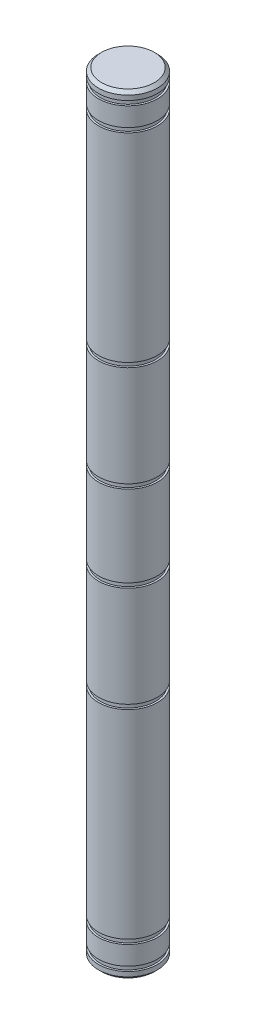
ISO-10303-21;
HEADER;
FILE_DESCRIPTION(('STEP AP214'),'2;1');
FILE_NAME('part.step','',(''),(''),'','','');
FILE_SCHEMA(('AUTOMOTIVE_DESIGN { 1 0 10303 214 1 1 1 1 }'));
ENDSEC;
DATA;
#1=APPLICATION_CONTEXT('core data for automotive mechanical design processes');
#2=APPLICATION_PROTOCOL_DEFINITION('international standard','automotive_design',2000,#1);
#3=PRODUCT_CONTEXT('',#1,'mechanical');
#4=PRODUCT('Part','Part','',(#3));
#5=PRODUCT_RELATED_PRODUCT_CATEGORY('part','',(#4));
#6=PRODUCT_DEFINITION_FORMATION('','',#4);
#7=PRODUCT_DEFINITION_CONTEXT('part definition',#1,'design');
#8=PRODUCT_DEFINITION('design','',#6,#7);
#9=PRODUCT_DEFINITION_SHAPE('','',#8);
#10=(LENGTH_UNIT() NAMED_UNIT(*) SI_UNIT(.MILLI.,.METRE.));
#11=(NAMED_UNIT(*) PLANE_ANGLE_UNIT() SI_UNIT($,.RADIAN.));
#12=(NAMED_UNIT(*) SI_UNIT($,.STERADIAN.) SOLID_ANGLE_UNIT());
#13=UNCERTAINTY_MEASURE_WITH_UNIT(LENGTH_MEASURE(1.E-05),#10,'distance_accuracy_value','');
#14=(GEOMETRIC_REPRESENTATION_CONTEXT(3) GLOBAL_UNCERTAINTY_ASSIGNED_CONTEXT((#13)) GLOBAL_UNIT_ASSIGNED_CONTEXT((#10,
#11,#12)) REPRESENTATION_CONTEXT('',''));
#15=CARTESIAN_POINT('',(0.,0.,0.));
#16=DIRECTION('',(0.,0.,1.));
#17=DIRECTION('',(1.,0.,0.));
#18=AXIS2_PLACEMENT_3D('',#15,#16,#17);
#19=CARTESIAN_POINT('',(0.,-62.23,0.));
#20=DIRECTION('',(0.,-1.,0.));
#21=DIRECTION('',(1.,0.,0.));
#22=AXIS2_PLACEMENT_3D('',#19,#20,#21);
#23=PLANE('',#22);
#24=CARTESIAN_POINT('',(0.,-62.23,0.));
#25=DIRECTION('',(0.,-1.,0.));
#26=DIRECTION('',(1.,0.,0.));
#27=AXIS2_PLACEMENT_3D('',#24,#25,#26);
#28=CIRCLE('',#27,4.25449999999998);
#29=CARTESIAN_POINT('',(4.25449999999998,-62.23,0.));
#30=VERTEX_POINT('',#29);
#31=EDGE_CURVE('E56',#30,#30,#28,.T.);
#32=ORIENTED_EDGE('',*,*,#31,.T.);
#33=EDGE_LOOP('',(#32));
#34=FACE_BOUND('',#33,.T.);
#35=ADVANCED_FACE('F45',(#34),#23,.T.);
#36=CARTESIAN_POINT('',(0.,62.23,0.));
#37=DIRECTION('',(0.,1.,0.));
#38=DIRECTION('',(-1.,0.,0.));
#39=AXIS2_PLACEMENT_3D('',#36,#37,#38);
#40=CYLINDRICAL_SURFACE('',#39,4.76249999999998);
#41=CARTESIAN_POINT('',(0.,-61.722,0.));
#42=DIRECTION('',(0.,-1.,0.));
#43=DIRECTION('',(1.,0.,0.));
#44=AXIS2_PLACEMENT_3D('',#41,#42,#43);
#45=CIRCLE('',#44,4.76249999999998);
#46=CARTESIAN_POINT('',(4.76249999999998,-61.722,0.));
#47=VERTEX_POINT('',#46);
#48=EDGE_CURVE('E60',#47,#47,#45,.F.);
#49=ORIENTED_EDGE('',*,*,#48,.T.);
#50=EDGE_LOOP('',(#49));
#51=FACE_BOUND('',#50,.T.);
#52=CARTESIAN_POINT('',(0.,-60.96,0.));
#53=DIRECTION('',(0.,1.,0.));
#54=DIRECTION('',(-1.,0.,0.));
#55=AXIS2_PLACEMENT_3D('',#52,#53,#54);
#56=CIRCLE('',#55,4.76249999999998);
#57=CARTESIAN_POINT('',(-4.76249999999998,-60.96,0.));
#58=VERTEX_POINT('',#57);
#59=EDGE_CURVE('E65',#58,#58,#56,.T.);
#60=ORIENTED_EDGE('',*,*,#59,.F.);
#61=EDGE_LOOP('',(#60));
#62=FACE_BOUND('',#61,.T.);
#63=ADVANCED_FACE('F179',(#51,#62),#40,.T.);
#64=CARTESIAN_POINT('',(-4.76249999999998,-60.96,0.));
#65=DIRECTION('',(0.,1.,0.));
#66=DIRECTION('',(-1.,0.,0.));
#67=AXIS2_PLACEMENT_3D('',#64,#65,#66);
#68=PLANE('',#67);
#69=ORIENTED_EDGE('',*,*,#59,.T.);
#70=EDGE_LOOP('',(#69));
#71=FACE_BOUND('',#70,.T.);
#72=CARTESIAN_POINT('',(0.,-60.96,0.));
#73=DIRECTION('',(0.,1.,0.));
#74=DIRECTION('',(-1.,0.,0.));
#75=AXIS2_PLACEMENT_3D('',#72,#73,#74);
#76=CIRCLE('',#75,4.45769999999998);
#77=CARTESIAN_POINT('',(-4.45769999999998,-60.96,0.));
#78=VERTEX_POINT('',#77);
#79=EDGE_CURVE('E68',#78,#78,#76,.T.);
#80=ORIENTED_EDGE('',*,*,#79,.F.);
#81=EDGE_LOOP('',(#80));
#82=FACE_BOUND('',#81,.T.);
#83=ADVANCED_FACE('F185',(#71,#82),#68,.T.);
#84=CARTESIAN_POINT('',(0.,62.23,0.));
#85=DIRECTION('',(0.,1.,0.));
#86=DIRECTION('',(-1.,0.,0.));
#87=AXIS2_PLACEMENT_3D('',#84,#85,#86);
#88=CYLINDRICAL_SURFACE('',#87,4.45769999999998);
#89=ORIENTED_EDGE('',*,*,#79,.T.);
#90=EDGE_LOOP('',(#89));
#91=FACE_BOUND('',#90,.T.);
#92=CARTESIAN_POINT('',(0.,-60.2234,0.));
#93=DIRECTION('',(0.,1.,0.));
#94=DIRECTION('',(-1.,0.,0.));
#95=AXIS2_PLACEMENT_3D('',#92,#93,#94);
#96=CIRCLE('',#95,4.45769999999998);
#97=CARTESIAN_POINT('',(-4.45769999999998,-60.2234,0.));
#98=VERTEX_POINT('',#97);
#99=EDGE_CURVE('E71',#98,#98,#96,.T.);
#100=ORIENTED_EDGE('',*,*,#99,.F.);
#101=EDGE_LOOP('',(#100));
#102=FACE_BOUND('',#101,.T.);
#103=ADVANCED_FACE('F206',(#91,#102),#88,.T.);
#104=CARTESIAN_POINT('',(-4.76249999999998,-60.2234,0.));
#105=DIRECTION('',(0.,-1.,0.));
#106=DIRECTION('',(1.,0.,0.));
#107=AXIS2_PLACEMENT_3D('',#104,#105,#106);
#108=PLANE('',#107);
#109=ORIENTED_EDGE('',*,*,#99,.T.);
#110=EDGE_LOOP('',(#109));
#111=FACE_BOUND('',#110,.T.);
#112=CARTESIAN_POINT('',(0.,-60.2234,0.));
#113=DIRECTION('',(0.,1.,0.));
#114=DIRECTION('',(-1.,0.,0.));
#115=AXIS2_PLACEMENT_3D('',#112,#113,#114);
#116=CIRCLE('',#115,4.76249999999998);
#117=CARTESIAN_POINT('',(-4.76249999999998,-60.2234,0.));
#118=VERTEX_POINT('',#117);
#119=EDGE_CURVE('E74',#118,#118,#116,.T.);
#120=ORIENTED_EDGE('',*,*,#119,.F.);
#121=EDGE_LOOP('',(#120));
#122=FACE_BOUND('',#121,.T.);
#123=ADVANCED_FACE('F211',(#111,#122),#108,.T.);
#124=CARTESIAN_POINT('',(0.,62.23,0.));
#125=DIRECTION('',(0.,1.,0.));
#126=DIRECTION('',(-1.,0.,0.));
#127=AXIS2_PLACEMENT_3D('',#124,#125,#126);
#128=CYLINDRICAL_SURFACE('',#127,4.76249999999998);
#129=ORIENTED_EDGE('',*,*,#119,.T.);
#130=EDGE_LOOP('',(#129));
#131=FACE_BOUND('',#130,.T.);
#132=CARTESIAN_POINT('',(0.,-57.1754,0.));
#133=DIRECTION('',(0.,1.,0.));
#134=DIRECTION('',(-1.,0.,0.));
#135=AXIS2_PLACEMENT_3D('',#132,#133,#134);
#136=CIRCLE('',#135,4.76249999999998);
#137=CARTESIAN_POINT('',(-4.76249999999998,-57.1754,0.));
#138=VERTEX_POINT('',#137);
#139=EDGE_CURVE('E77',#138,#138,#136,.T.);
#140=ORIENTED_EDGE('',*,*,#139,.F.);
#141=EDGE_LOOP('',(#140));
#142=FACE_BOUND('',#141,.T.);
#143=ADVANCED_FACE('F217',(#131,#142),#128,.T.);
#144=CARTESIAN_POINT('',(-4.76249999999998,-57.1754,0.));
#145=DIRECTION('',(0.,1.,0.));
#146=DIRECTION('',(-1.,0.,0.));
#147=AXIS2_PLACEMENT_3D('',#144,#145,#146);
#148=PLANE('',#147);
#149=ORIENTED_EDGE('',*,*,#139,.T.);
#150=EDGE_LOOP('',(#149));
#151=FACE_BOUND('',#150,.T.);
#152=CARTESIAN_POINT('',(0.,-57.1754,0.));
#153=DIRECTION('',(0.,1.,0.));
#154=DIRECTION('',(-1.,0.,0.));
#155=AXIS2_PLACEMENT_3D('',#152,#153,#154);
#156=CIRCLE('',#155,4.45769999999998);
#157=CARTESIAN_POINT('',(-4.45769999999998,-57.1754,0.));
#158=VERTEX_POINT('',#157);
#159=EDGE_CURVE('E80',#158,#158,#156,.T.);
#160=ORIENTED_EDGE('',*,*,#159,.F.);
#161=EDGE_LOOP('',(#160));
#162=FACE_BOUND('',#161,.T.);
#163=ADVANCED_FACE('F223',(#151,#162),#148,.T.);
#164=CARTESIAN_POINT('',(0.,62.23,0.));
#165=DIRECTION('',(0.,1.,0.));
#166=DIRECTION('',(-1.,0.,0.));
#167=AXIS2_PLACEMENT_3D('',#164,#165,#166);
#168=CYLINDRICAL_SURFACE('',#167,4.45769999999998);
#169=ORIENTED_EDGE('',*,*,#159,.T.);
#170=EDGE_LOOP('',(#169));
#171=FACE_BOUND('',#170,.T.);
#172=CARTESIAN_POINT('',(0.,-56.4388,0.));
#173=DIRECTION('',(0.,1.,0.));
#174=DIRECTION('',(-1.,0.,0.));
#175=AXIS2_PLACEMENT_3D('',#172,#173,#174);
#176=CIRCLE('',#175,4.45769999999999);
#177=CARTESIAN_POINT('',(-4.45769999999999,-56.4388,0.));
#178=VERTEX_POINT('',#177);
#179=EDGE_CURVE('E83',#178,#178,#176,.T.);
#180=ORIENTED_EDGE('',*,*,#179,.F.);
#181=EDGE_LOOP('',(#180));
#182=FACE_BOUND('',#181,.T.);
#183=ADVANCED_FACE('F229',(#171,#182),#168,.T.);
#184=CARTESIAN_POINT('',(-4.76249999999999,-56.4388,0.));
#185=DIRECTION('',(0.,-1.,0.));
#186=DIRECTION('',(1.,0.,0.));
#187=AXIS2_PLACEMENT_3D('',#184,#185,#186);
#188=PLANE('',#187);
#189=ORIENTED_EDGE('',*,*,#179,.T.);
#190=EDGE_LOOP('',(#189));
#191=FACE_BOUND('',#190,.T.);
#192=CARTESIAN_POINT('',(0.,-56.4388,0.));
#193=DIRECTION('',(0.,1.,0.));
#194=DIRECTION('',(-1.,0.,0.));
#195=AXIS2_PLACEMENT_3D('',#192,#193,#194);
#196=CIRCLE('',#195,4.76249999999999);
#197=CARTESIAN_POINT('',(-4.76249999999999,-56.4388,0.));
#198=VERTEX_POINT('',#197);
#199=EDGE_CURVE('E86',#198,#198,#196,.T.);
#200=ORIENTED_EDGE('',*,*,#199,.F.);
#201=EDGE_LOOP('',(#200));
#202=FACE_BOUND('',#201,.T.);
#203=ADVANCED_FACE('F235',(#191,#202),#188,.T.);
#204=CARTESIAN_POINT('',(0.,62.23,0.));
#205=DIRECTION('',(0.,1.,0.));
#206=DIRECTION('',(-1.,0.,0.));
#207=AXIS2_PLACEMENT_3D('',#204,#205,#206);
#208=CYLINDRICAL_SURFACE('',#207,4.76249999999999);
#209=ORIENTED_EDGE('',*,*,#199,.T.);
#210=EDGE_LOOP('',(#209));
#211=FACE_BOUND('',#210,.T.);
#212=CARTESIAN_POINT('',(0.,-24.2951,0.));
#213=DIRECTION('',(0.,1.,0.));
#214=DIRECTION('',(-1.,0.,0.));
#215=AXIS2_PLACEMENT_3D('',#212,#213,#214);
#216=CIRCLE('',#215,4.76249999999999);
#217=CARTESIAN_POINT('',(-4.76249999999999,-24.2951,0.));
#218=VERTEX_POINT('',#217);
#219=EDGE_CURVE('E89',#218,#218,#216,.T.);
#220=ORIENTED_EDGE('',*,*,#219,.F.);
#221=EDGE_LOOP('',(#220));
#222=FACE_BOUND('',#221,.T.);
#223=ADVANCED_FACE('F241',(#211,#222),#208,.T.);
#224=CARTESIAN_POINT('',(-4.76249999999999,-24.2951,0.));
#225=DIRECTION('',(0.,1.,0.));
#226=DIRECTION('',(-1.,0.,0.));
#227=AXIS2_PLACEMENT_3D('',#224,#225,#226);
#228=PLANE('',#227);
#229=ORIENTED_EDGE('',*,*,#219,.T.);
#230=EDGE_LOOP('',(#229));
#231=FACE_BOUND('',#230,.T.);
#232=CARTESIAN_POINT('',(0.,-24.2951,0.));
#233=DIRECTION('',(0.,1.,0.));
#234=DIRECTION('',(-1.,0.,0.));
#235=AXIS2_PLACEMENT_3D('',#232,#233,#234);
#236=CIRCLE('',#235,4.45769999999999);
#237=CARTESIAN_POINT('',(-4.45769999999999,-24.2951,0.));
#238=VERTEX_POINT('',#237);
#239=EDGE_CURVE('E92',#238,#238,#236,.T.);
#240=ORIENTED_EDGE('',*,*,#239,.F.);
#241=EDGE_LOOP('',(#240));
#242=FACE_BOUND('',#241,.T.);
#243=ADVANCED_FACE('F247',(#231,#242),#228,.T.);
#244=CARTESIAN_POINT('',(0.,62.23,0.));
#245=DIRECTION('',(0.,1.,0.));
#246=DIRECTION('',(-1.,0.,0.));
#247=AXIS2_PLACEMENT_3D('',#244,#245,#246);
#248=CYLINDRICAL_SURFACE('',#247,4.45769999999999);
#249=ORIENTED_EDGE('',*,*,#239,.T.);
#250=EDGE_LOOP('',(#249));
#251=FACE_BOUND('',#250,.T.);
#252=CARTESIAN_POINT('',(0.,-23.5585,0.));
#253=DIRECTION('',(0.,1.,0.));
#254=DIRECTION('',(-1.,0.,0.));
#255=AXIS2_PLACEMENT_3D('',#252,#253,#254);
#256=CIRCLE('',#255,4.45769999999999);
#257=CARTESIAN_POINT('',(-4.45769999999999,-23.5585,0.));
#258=VERTEX_POINT('',#257);
#259=EDGE_CURVE('E95',#258,#258,#256,.T.);
#260=ORIENTED_EDGE('',*,*,#259,.F.);
#261=EDGE_LOOP('',(#260));
#262=FACE_BOUND('',#261,.T.);
#263=ADVANCED_FACE('F253',(#251,#262),#248,.T.);
#264=CARTESIAN_POINT('',(-4.76249999999999,-23.5585,0.));
#265=DIRECTION('',(0.,-1.,0.));
#266=DIRECTION('',(1.,0.,0.));
#267=AXIS2_PLACEMENT_3D('',#264,#265,#266);
#268=PLANE('',#267);
#269=ORIENTED_EDGE('',*,*,#259,.T.);
#270=EDGE_LOOP('',(#269));
#271=FACE_BOUND('',#270,.T.);
#272=CARTESIAN_POINT('',(0.,-23.5585,0.));
#273=DIRECTION('',(0.,1.,0.));
#274=DIRECTION('',(-1.,0.,0.));
#275=AXIS2_PLACEMENT_3D('',#272,#273,#274);
#276=CIRCLE('',#275,4.76249999999999);
#277=CARTESIAN_POINT('',(-4.76249999999999,-23.5585,0.));
#278=VERTEX_POINT('',#277);
#279=EDGE_CURVE('E98',#278,#278,#276,.T.);
#280=ORIENTED_EDGE('',*,*,#279,.F.);
#281=EDGE_LOOP('',(#280));
#282=FACE_BOUND('',#281,.T.);
#283=ADVANCED_FACE('F259',(#271,#282),#268,.T.);
#284=CARTESIAN_POINT('',(0.,62.23,0.));
#285=DIRECTION('',(0.,1.,0.));
#286=DIRECTION('',(-1.,0.,0.));
#287=AXIS2_PLACEMENT_3D('',#284,#285,#286);
#288=CYLINDRICAL_SURFACE('',#287,4.76249999999999);
#289=ORIENTED_EDGE('',*,*,#279,.T.);
#290=EDGE_LOOP('',(#289));
#291=FACE_BOUND('',#290,.T.);
#292=CARTESIAN_POINT('',(0.,-7.3025,0.));
#293=DIRECTION('',(0.,1.,0.));
#294=DIRECTION('',(-1.,0.,0.));
#295=AXIS2_PLACEMENT_3D('',#292,#293,#294);
#296=CIRCLE('',#295,4.76249999999999);
#297=CARTESIAN_POINT('',(-4.76249999999999,-7.3025,0.));
#298=VERTEX_POINT('',#297);
#299=EDGE_CURVE('E101',#298,#298,#296,.T.);
#300=ORIENTED_EDGE('',*,*,#299,.F.);
#301=EDGE_LOOP('',(#300));
#302=FACE_BOUND('',#301,.T.);
#303=ADVANCED_FACE('F265',(#291,#302),#288,.T.);
#304=CARTESIAN_POINT('',(-4.76249999999999,-7.3025,0.));
#305=DIRECTION('',(0.,1.,0.));
#306=DIRECTION('',(-1.,0.,0.));
#307=AXIS2_PLACEMENT_3D('',#304,#305,#306);
#308=PLANE('',#307);
#309=ORIENTED_EDGE('',*,*,#299,.T.);
#310=EDGE_LOOP('',(#309));
#311=FACE_BOUND('',#310,.T.);
#312=CARTESIAN_POINT('',(0.,-7.3025,0.));
#313=DIRECTION('',(0.,1.,0.));
#314=DIRECTION('',(-1.,0.,0.));
#315=AXIS2_PLACEMENT_3D('',#312,#313,#314);
#316=CIRCLE('',#315,4.45769999999999);
#317=CARTESIAN_POINT('',(-4.45769999999999,-7.3025,0.));
#318=VERTEX_POINT('',#317);
#319=EDGE_CURVE('E104',#318,#318,#316,.T.);
#320=ORIENTED_EDGE('',*,*,#319,.F.);
#321=EDGE_LOOP('',(#320));
#322=FACE_BOUND('',#321,.T.);
#323=ADVANCED_FACE('F271',(#311,#322),#308,.T.);
#324=CARTESIAN_POINT('',(0.,62.23,0.));
#325=DIRECTION('',(0.,1.,0.));
#326=DIRECTION('',(-1.,0.,0.));
#327=AXIS2_PLACEMENT_3D('',#324,#325,#326);
#328=CYLINDRICAL_SURFACE('',#327,4.45769999999999);
#329=ORIENTED_EDGE('',*,*,#319,.T.);
#330=EDGE_LOOP('',(#329));
#331=FACE_BOUND('',#330,.T.);
#332=CARTESIAN_POINT('',(0.,-6.5659,0.));
#333=DIRECTION('',(0.,1.,0.));
#334=DIRECTION('',(-1.,0.,0.));
#335=AXIS2_PLACEMENT_3D('',#332,#333,#334);
#336=CIRCLE('',#335,4.45769999999999);
#337=CARTESIAN_POINT('',(-4.45769999999999,-6.5659,0.));
#338=VERTEX_POINT('',#337);
#339=EDGE_CURVE('E107',#338,#338,#336,.T.);
#340=ORIENTED_EDGE('',*,*,#339,.F.);
#341=EDGE_LOOP('',(#340));
#342=FACE_BOUND('',#341,.T.);
#343=ADVANCED_FACE('F277',(#331,#342),#328,.T.);
#344=CARTESIAN_POINT('',(-4.76249999999999,-6.5659,0.));
#345=DIRECTION('',(0.,-1.,0.));
#346=DIRECTION('',(1.,0.,0.));
#347=AXIS2_PLACEMENT_3D('',#344,#345,#346);
#348=PLANE('',#347);
#349=ORIENTED_EDGE('',*,*,#339,.T.);
#350=EDGE_LOOP('',(#349));
#351=FACE_BOUND('',#350,.T.);
#352=CARTESIAN_POINT('',(0.,-6.5659,0.));
#353=DIRECTION('',(0.,1.,0.));
#354=DIRECTION('',(-1.,0.,0.));
#355=AXIS2_PLACEMENT_3D('',#352,#353,#354);
#356=CIRCLE('',#355,4.76249999999999);
#357=CARTESIAN_POINT('',(-4.76249999999999,-6.5659,0.));
#358=VERTEX_POINT('',#357);
#359=EDGE_CURVE('E110',#358,#358,#356,.T.);
#360=ORIENTED_EDGE('',*,*,#359,.F.);
#361=EDGE_LOOP('',(#360));
#362=FACE_BOUND('',#361,.T.);
#363=ADVANCED_FACE('F283',(#351,#362),#348,.T.);
#364=CARTESIAN_POINT('',(0.,62.23,0.));
#365=DIRECTION('',(0.,1.,0.));
#366=DIRECTION('',(-1.,0.,0.));
#367=AXIS2_PLACEMENT_3D('',#364,#365,#366);
#368=CYLINDRICAL_SURFACE('',#367,4.76249999999999);
#369=ORIENTED_EDGE('',*,*,#359,.T.);
#370=EDGE_LOOP('',(#369));
#371=FACE_BOUND('',#370,.T.);
#372=CARTESIAN_POINT('',(0.,6.5659,0.));
#373=DIRECTION('',(0.,1.,0.));
#374=DIRECTION('',(-1.,0.,0.));
#375=AXIS2_PLACEMENT_3D('',#372,#373,#374);
#376=CIRCLE('',#375,4.76249999999999);
#377=CARTESIAN_POINT('',(-4.76249999999999,6.5659,0.));
#378=VERTEX_POINT('',#377);
#379=EDGE_CURVE('E113',#378,#378,#376,.T.);
#380=ORIENTED_EDGE('',*,*,#379,.F.);
#381=EDGE_LOOP('',(#380));
#382=FACE_BOUND('',#381,.T.);
#383=ADVANCED_FACE('F289',(#371,#382),#368,.T.);
#384=CARTESIAN_POINT('',(-4.76249999999999,6.5659,0.));
#385=DIRECTION('',(0.,1.,0.));
#386=DIRECTION('',(-1.,0.,0.));
#387=AXIS2_PLACEMENT_3D('',#384,#385,#386);
#388=PLANE('',#387);
#389=ORIENTED_EDGE('',*,*,#379,.T.);
#390=EDGE_LOOP('',(#389));
#391=FACE_BOUND('',#390,.T.);
#392=CARTESIAN_POINT('',(0.,6.5659,0.));
#393=DIRECTION('',(0.,1.,0.));
#394=DIRECTION('',(-1.,0.,0.));
#395=AXIS2_PLACEMENT_3D('',#392,#393,#394);
#396=CIRCLE('',#395,4.45769999999999);
#397=CARTESIAN_POINT('',(-4.45769999999999,6.5659,0.));
#398=VERTEX_POINT('',#397);
#399=EDGE_CURVE('E116',#398,#398,#396,.T.);
#400=ORIENTED_EDGE('',*,*,#399,.F.);
#401=EDGE_LOOP('',(#400));
#402=FACE_BOUND('',#401,.T.);
#403=ADVANCED_FACE('F295',(#391,#402),#388,.T.);
#404=CARTESIAN_POINT('',(0.,62.23,0.));
#405=DIRECTION('',(0.,1.,0.));
#406=DIRECTION('',(-1.,0.,0.));
#407=AXIS2_PLACEMENT_3D('',#404,#405,#406);
#408=CYLINDRICAL_SURFACE('',#407,4.45769999999999);
#409=ORIENTED_EDGE('',*,*,#399,.T.);
#410=EDGE_LOOP('',(#409));
#411=FACE_BOUND('',#410,.T.);
#412=CARTESIAN_POINT('',(0.,7.3025,0.));
#413=DIRECTION('',(0.,1.,0.));
#414=DIRECTION('',(-1.,0.,0.));
#415=AXIS2_PLACEMENT_3D('',#412,#413,#414);
#416=CIRCLE('',#415,4.45769999999999);
#417=CARTESIAN_POINT('',(-4.45769999999999,7.3025,0.));
#418=VERTEX_POINT('',#417);
#419=EDGE_CURVE('E119',#418,#418,#416,.T.);
#420=ORIENTED_EDGE('',*,*,#419,.F.);
#421=EDGE_LOOP('',(#420));
#422=FACE_BOUND('',#421,.T.);
#423=ADVANCED_FACE('F301',(#411,#422),#408,.T.);
#424=CARTESIAN_POINT('',(-4.76249999999999,7.3025,0.));
#425=DIRECTION('',(0.,-1.,0.));
#426=DIRECTION('',(1.,0.,0.));
#427=AXIS2_PLACEMENT_3D('',#424,#425,#426);
#428=PLANE('',#427);
#429=ORIENTED_EDGE('',*,*,#419,.T.);
#430=EDGE_LOOP('',(#429));
#431=FACE_BOUND('',#430,.T.);
#432=CARTESIAN_POINT('',(0.,7.3025,0.));
#433=DIRECTION('',(0.,1.,0.));
#434=DIRECTION('',(-1.,0.,0.));
#435=AXIS2_PLACEMENT_3D('',#432,#433,#434);
#436=CIRCLE('',#435,4.76249999999999);
#437=CARTESIAN_POINT('',(-4.76249999999999,7.3025,0.));
#438=VERTEX_POINT('',#437);
#439=EDGE_CURVE('E122',#438,#438,#436,.T.);
#440=ORIENTED_EDGE('',*,*,#439,.F.);
#441=EDGE_LOOP('',(#440));
#442=FACE_BOUND('',#441,.T.);
#443=ADVANCED_FACE('F307',(#431,#442),#428,.T.);
#444=CARTESIAN_POINT('',(0.,62.23,0.));
#445=DIRECTION('',(0.,1.,0.));
#446=DIRECTION('',(-1.,0.,0.));
#447=AXIS2_PLACEMENT_3D('',#444,#445,#446);
#448=CYLINDRICAL_SURFACE('',#447,4.76249999999999);
#449=ORIENTED_EDGE('',*,*,#439,.T.);
#450=EDGE_LOOP('',(#449));
#451=FACE_BOUND('',#450,.T.);
#452=CARTESIAN_POINT('',(0.,23.5585,0.));
#453=DIRECTION('',(0.,1.,0.));
#454=DIRECTION('',(-1.,0.,0.));
#455=AXIS2_PLACEMENT_3D('',#452,#453,#454);
#456=CIRCLE('',#455,4.7625);
#457=CARTESIAN_POINT('',(-4.7625,23.5585,0.));
#458=VERTEX_POINT('',#457);
#459=EDGE_CURVE('E125',#458,#458,#456,.T.);
#460=ORIENTED_EDGE('',*,*,#459,.F.);
#461=EDGE_LOOP('',(#460));
#462=FACE_BOUND('',#461,.T.);
#463=ADVANCED_FACE('F313',(#451,#462),#448,.T.);
#464=CARTESIAN_POINT('',(-4.7625,23.5585,0.));
#465=DIRECTION('',(0.,1.,0.));
#466=DIRECTION('',(-1.,0.,0.));
#467=AXIS2_PLACEMENT_3D('',#464,#465,#466);
#468=PLANE('',#467);
#469=ORIENTED_EDGE('',*,*,#459,.T.);
#470=EDGE_LOOP('',(#469));
#471=FACE_BOUND('',#470,.T.);
#472=CARTESIAN_POINT('',(0.,23.5585,0.));
#473=DIRECTION('',(0.,1.,0.));
#474=DIRECTION('',(-1.,0.,0.));
#475=AXIS2_PLACEMENT_3D('',#472,#473,#474);
#476=CIRCLE('',#475,4.45769999999999);
#477=CARTESIAN_POINT('',(-4.45769999999999,23.5585,0.));
#478=VERTEX_POINT('',#477);
#479=EDGE_CURVE('E128',#478,#478,#476,.T.);
#480=ORIENTED_EDGE('',*,*,#479,.F.);
#481=EDGE_LOOP('',(#480));
#482=FACE_BOUND('',#481,.T.);
#483=ADVANCED_FACE('F319',(#471,#482),#468,.T.);
#484=CARTESIAN_POINT('',(0.,62.23,0.));
#485=DIRECTION('',(0.,1.,0.));
#486=DIRECTION('',(-1.,0.,0.));
#487=AXIS2_PLACEMENT_3D('',#484,#485,#486);
#488=CYLINDRICAL_SURFACE('',#487,4.45769999999999);
#489=ORIENTED_EDGE('',*,*,#479,.T.);
#490=EDGE_LOOP('',(#489));
#491=FACE_BOUND('',#490,.T.);
#492=CARTESIAN_POINT('',(0.,24.2951,0.));
#493=DIRECTION('',(0.,1.,0.));
#494=DIRECTION('',(-1.,0.,0.));
#495=AXIS2_PLACEMENT_3D('',#492,#493,#494);
#496=CIRCLE('',#495,4.45769999999999);
#497=CARTESIAN_POINT('',(-4.45769999999999,24.2951,0.));
#498=VERTEX_POINT('',#497);
#499=EDGE_CURVE('E131',#498,#498,#496,.T.);
#500=ORIENTED_EDGE('',*,*,#499,.F.);
#501=EDGE_LOOP('',(#500));
#502=FACE_BOUND('',#501,.T.);
#503=ADVANCED_FACE('F325',(#491,#502),#488,.T.);
#504=CARTESIAN_POINT('',(-4.76249999999999,24.2951,0.));
#505=DIRECTION('',(0.,-1.,0.));
#506=DIRECTION('',(1.,0.,0.));
#507=AXIS2_PLACEMENT_3D('',#504,#505,#506);
#508=PLANE('',#507);
#509=ORIENTED_EDGE('',*,*,#499,.T.);
#510=EDGE_LOOP('',(#509));
#511=FACE_BOUND('',#510,.T.);
#512=CARTESIAN_POINT('',(0.,24.2951,0.));
#513=DIRECTION('',(0.,1.,0.));
#514=DIRECTION('',(-1.,0.,0.));
#515=AXIS2_PLACEMENT_3D('',#512,#513,#514);
#516=CIRCLE('',#515,4.76249999999999);
#517=CARTESIAN_POINT('',(-4.76249999999999,24.2951,0.));
#518=VERTEX_POINT('',#517);
#519=EDGE_CURVE('E134',#518,#518,#516,.T.);
#520=ORIENTED_EDGE('',*,*,#519,.F.);
#521=EDGE_LOOP('',(#520));
#522=FACE_BOUND('',#521,.T.);
#523=ADVANCED_FACE('F331',(#511,#522),#508,.T.);
#524=CARTESIAN_POINT('',(0.,62.23,0.));
#525=DIRECTION('',(0.,1.,0.));
#526=DIRECTION('',(-1.,0.,0.));
#527=AXIS2_PLACEMENT_3D('',#524,#525,#526);
#528=CYLINDRICAL_SURFACE('',#527,4.7625);
#529=ORIENTED_EDGE('',*,*,#519,.T.);
#530=EDGE_LOOP('',(#529));
#531=FACE_BOUND('',#530,.T.);
#532=CARTESIAN_POINT('',(0.,56.4388,0.));
#533=DIRECTION('',(0.,1.,0.));
#534=DIRECTION('',(-1.,0.,0.));
#535=AXIS2_PLACEMENT_3D('',#532,#533,#534);
#536=CIRCLE('',#535,4.7625);
#537=CARTESIAN_POINT('',(-4.7625,56.4388,0.));
#538=VERTEX_POINT('',#537);
#539=EDGE_CURVE('E137',#538,#538,#536,.T.);
#540=ORIENTED_EDGE('',*,*,#539,.F.);
#541=EDGE_LOOP('',(#540));
#542=FACE_BOUND('',#541,.T.);
#543=ADVANCED_FACE('F337',(#531,#542),#528,.T.);
#544=CARTESIAN_POINT('',(-4.7625,56.4388,0.));
#545=DIRECTION('',(0.,1.,0.));
#546=DIRECTION('',(-1.,0.,0.));
#547=AXIS2_PLACEMENT_3D('',#544,#545,#546);
#548=PLANE('',#547);
#549=ORIENTED_EDGE('',*,*,#539,.T.);
#550=EDGE_LOOP('',(#549));
#551=FACE_BOUND('',#550,.T.);
#552=CARTESIAN_POINT('',(0.,56.4388,0.));
#553=DIRECTION('',(0.,1.,0.));
#554=DIRECTION('',(-1.,0.,0.));
#555=AXIS2_PLACEMENT_3D('',#552,#553,#554);
#556=CIRCLE('',#555,4.4577);
#557=CARTESIAN_POINT('',(-4.4577,56.4388,0.));
#558=VERTEX_POINT('',#557);
#559=EDGE_CURVE('E140',#558,#558,#556,.T.);
#560=ORIENTED_EDGE('',*,*,#559,.F.);
#561=EDGE_LOOP('',(#560));
#562=FACE_BOUND('',#561,.T.);
#563=ADVANCED_FACE('F343',(#551,#562),#548,.T.);
#564=CARTESIAN_POINT('',(0.,62.23,0.));
#565=DIRECTION('',(0.,1.,0.));
#566=DIRECTION('',(-1.,0.,0.));
#567=AXIS2_PLACEMENT_3D('',#564,#565,#566);
#568=CYLINDRICAL_SURFACE('',#567,4.4577);
#569=ORIENTED_EDGE('',*,*,#559,.T.);
#570=EDGE_LOOP('',(#569));
#571=FACE_BOUND('',#570,.T.);
#572=CARTESIAN_POINT('',(0.,57.1754,0.));
#573=DIRECTION('',(0.,1.,0.));
#574=DIRECTION('',(-1.,0.,0.));
#575=AXIS2_PLACEMENT_3D('',#572,#573,#574);
#576=CIRCLE('',#575,4.4577);
#577=CARTESIAN_POINT('',(-4.4577,57.1754,0.));
#578=VERTEX_POINT('',#577);
#579=EDGE_CURVE('E143',#578,#578,#576,.T.);
#580=ORIENTED_EDGE('',*,*,#579,.F.);
#581=EDGE_LOOP('',(#580));
#582=FACE_BOUND('',#581,.T.);
#583=ADVANCED_FACE('F349',(#571,#582),#568,.T.);
#584=CARTESIAN_POINT('',(-4.7625,57.1754,0.));
#585=DIRECTION('',(0.,-1.,0.));
#586=DIRECTION('',(1.,0.,0.));
#587=AXIS2_PLACEMENT_3D('',#584,#585,#586);
#588=PLANE('',#587);
#589=ORIENTED_EDGE('',*,*,#579,.T.);
#590=EDGE_LOOP('',(#589));
#591=FACE_BOUND('',#590,.T.);
#592=CARTESIAN_POINT('',(0.,57.1754,0.));
#593=DIRECTION('',(0.,1.,0.));
#594=DIRECTION('',(-1.,0.,0.));
#595=AXIS2_PLACEMENT_3D('',#592,#593,#594);
#596=CIRCLE('',#595,4.7625);
#597=CARTESIAN_POINT('',(-4.7625,57.1754,0.));
#598=VERTEX_POINT('',#597);
#599=EDGE_CURVE('E146',#598,#598,#596,.T.);
#600=ORIENTED_EDGE('',*,*,#599,.F.);
#601=EDGE_LOOP('',(#600));
#602=FACE_BOUND('',#601,.T.);
#603=ADVANCED_FACE('F355',(#591,#602),#588,.T.);
#604=CARTESIAN_POINT('',(0.,62.23,0.));
#605=DIRECTION('',(0.,1.,0.));
#606=DIRECTION('',(-1.,0.,0.));
#607=AXIS2_PLACEMENT_3D('',#604,#605,#606);
#608=CYLINDRICAL_SURFACE('',#607,4.7625);
#609=ORIENTED_EDGE('',*,*,#599,.T.);
#610=EDGE_LOOP('',(#609));
#611=FACE_BOUND('',#610,.T.);
#612=CARTESIAN_POINT('',(0.,60.2234,0.));
#613=DIRECTION('',(0.,1.,0.));
#614=DIRECTION('',(-1.,0.,0.));
#615=AXIS2_PLACEMENT_3D('',#612,#613,#614);
#616=CIRCLE('',#615,4.7625);
#617=CARTESIAN_POINT('',(-4.7625,60.2234,0.));
#618=VERTEX_POINT('',#617);
#619=EDGE_CURVE('E149',#618,#618,#616,.T.);
#620=ORIENTED_EDGE('',*,*,#619,.F.);
#621=EDGE_LOOP('',(#620));
#622=FACE_BOUND('',#621,.T.);
#623=ADVANCED_FACE('F361',(#611,#622),#608,.T.);
#624=CARTESIAN_POINT('',(-4.7625,60.2234,0.));
#625=DIRECTION('',(0.,1.,0.));
#626=DIRECTION('',(-1.,0.,0.));
#627=AXIS2_PLACEMENT_3D('',#624,#625,#626);
#628=PLANE('',#627);
#629=ORIENTED_EDGE('',*,*,#619,.T.);
#630=EDGE_LOOP('',(#629));
#631=FACE_BOUND('',#630,.T.);
#632=CARTESIAN_POINT('',(0.,60.2234,0.));
#633=DIRECTION('',(0.,1.,0.));
#634=DIRECTION('',(-1.,0.,0.));
#635=AXIS2_PLACEMENT_3D('',#632,#633,#634);
#636=CIRCLE('',#635,4.4577);
#637=CARTESIAN_POINT('',(-4.4577,60.2234,0.));
#638=VERTEX_POINT('',#637);
#639=EDGE_CURVE('E152',#638,#638,#636,.T.);
#640=ORIENTED_EDGE('',*,*,#639,.F.);
#641=EDGE_LOOP('',(#640));
#642=FACE_BOUND('',#641,.T.);
#643=ADVANCED_FACE('F175',(#631,#642),#628,.T.);
#644=CARTESIAN_POINT('',(0.,62.23,0.));
#645=DIRECTION('',(0.,1.,0.));
#646=DIRECTION('',(-1.,0.,0.));
#647=AXIS2_PLACEMENT_3D('',#644,#645,#646);
#648=CYLINDRICAL_SURFACE('',#647,4.4577);
#649=ORIENTED_EDGE('',*,*,#639,.T.);
#650=EDGE_LOOP('',(#649));
#651=FACE_BOUND('',#650,.T.);
#652=CARTESIAN_POINT('',(0.,60.96,0.));
#653=DIRECTION('',(0.,1.,0.));
#654=DIRECTION('',(-1.,0.,0.));
#655=AXIS2_PLACEMENT_3D('',#652,#653,#654);
#656=CIRCLE('',#655,4.4577);
#657=CARTESIAN_POINT('',(-4.4577,60.96,0.));
#658=VERTEX_POINT('',#657);
#659=EDGE_CURVE('E155',#658,#658,#656,.T.);
#660=ORIENTED_EDGE('',*,*,#659,.F.);
#661=EDGE_LOOP('',(#660));
#662=FACE_BOUND('',#661,.T.);
#663=ADVANCED_FACE('F166',(#651,#662),#648,.T.);
#664=CARTESIAN_POINT('',(-4.7625,60.96,0.));
#665=DIRECTION('',(0.,-1.,0.));
#666=DIRECTION('',(1.,0.,0.));
#667=AXIS2_PLACEMENT_3D('',#664,#665,#666);
#668=PLANE('',#667);
#669=ORIENTED_EDGE('',*,*,#659,.T.);
#670=EDGE_LOOP('',(#669));
#671=FACE_BOUND('',#670,.T.);
#672=CARTESIAN_POINT('',(0.,60.96,0.));
#673=DIRECTION('',(0.,1.,0.));
#674=DIRECTION('',(-1.,0.,0.));
#675=AXIS2_PLACEMENT_3D('',#672,#673,#674);
#676=CIRCLE('',#675,4.7625);
#677=CARTESIAN_POINT('',(-4.7625,60.96,0.));
#678=VERTEX_POINT('',#677);
#679=EDGE_CURVE('E158',#678,#678,#676,.T.);
#680=ORIENTED_EDGE('',*,*,#679,.F.);
#681=EDGE_LOOP('',(#680));
#682=FACE_BOUND('',#681,.T.);
#683=ADVANCED_FACE('F164',(#671,#682),#668,.T.);
#684=CARTESIAN_POINT('',(0.,62.23,0.));
#685=DIRECTION('',(0.,1.,0.));
#686=DIRECTION('',(-1.,0.,0.));
#687=AXIS2_PLACEMENT_3D('',#684,#685,#686);
#688=CYLINDRICAL_SURFACE('',#687,4.7625);
#689=CARTESIAN_POINT('',(0.,61.722,0.));
#690=DIRECTION('',(0.,1.,0.));
#691=DIRECTION('',(-1.,0.,0.));
#692=AXIS2_PLACEMENT_3D('',#689,#690,#691);
#693=CIRCLE('',#692,4.7625);
#694=CARTESIAN_POINT('',(-4.7625,61.722,0.));
#695=VERTEX_POINT('',#694);
#696=EDGE_CURVE('E12',#695,#695,#693,.F.);
#697=ORIENTED_EDGE('',*,*,#696,.T.);
#698=EDGE_LOOP('',(#697));
#699=FACE_BOUND('',#698,.T.);
#700=ORIENTED_EDGE('',*,*,#679,.T.);
#701=EDGE_LOOP('',(#700));
#702=FACE_BOUND('',#701,.T.);
#703=ADVANCED_FACE('F162',(#699,#702),#688,.T.);
#704=CARTESIAN_POINT('',(0.,62.23,0.));
#705=DIRECTION('',(0.,1.,0.));
#706=DIRECTION('',(-1.,0.,0.));
#707=AXIS2_PLACEMENT_3D('',#704,#705,#706);
#708=PLANE('',#707);
#709=CARTESIAN_POINT('',(0.,62.23,0.));
#710=DIRECTION('',(0.,1.,0.));
#711=DIRECTION('',(-1.,0.,0.));
#712=AXIS2_PLACEMENT_3D('',#709,#710,#711);
#713=CIRCLE('',#712,4.2545);
#714=CARTESIAN_POINT('',(-4.2545,62.23,0.));
#715=VERTEX_POINT('',#714);
#716=EDGE_CURVE('E52',#715,#715,#713,.T.);
#717=ORIENTED_EDGE('',*,*,#716,.T.);
#718=EDGE_LOOP('',(#717));
#719=FACE_BOUND('',#718,.T.);
#720=ADVANCED_FACE('F173',(#719),#708,.T.);
#721=CARTESIAN_POINT('',(0.,-61.722,0.));
#722=DIRECTION('',(0.,1.,0.));
#723=DIRECTION('',(-1.,0.,0.));
#724=AXIS2_PLACEMENT_3D('',#721,#722,#723);
#725=CONICAL_SURFACE('',#724,4.76249999999998,0.785398163397463);
#726=ORIENTED_EDGE('',*,*,#31,.F.);
#727=EDGE_LOOP('',(#726));
#728=FACE_BOUND('',#727,.T.);
#729=ORIENTED_EDGE('',*,*,#48,.F.);
#730=EDGE_LOOP('',(#729));
#731=FACE_BOUND('',#730,.T.);
#732=ADVANCED_FACE('F189',(#728,#731),#725,.T.);
#733=CARTESIAN_POINT('',(0.,62.23,0.));
#734=DIRECTION('',(0.,-1.,0.));
#735=DIRECTION('',(1.,0.,0.));
#736=AXIS2_PLACEMENT_3D('',#733,#734,#735);
#737=CONICAL_SURFACE('',#736,4.2545,0.785398163397443);
#738=ORIENTED_EDGE('',*,*,#696,.F.);
#739=EDGE_LOOP('',(#738));
#740=FACE_BOUND('',#739,.T.);
#741=ORIENTED_EDGE('',*,*,#716,.F.);
#742=EDGE_LOOP('',(#741));
#743=FACE_BOUND('',#742,.T.);
#744=ADVANCED_FACE('F47',(#740,#743),#737,.T.);
#745=CLOSED_SHELL('',(#35,#63,#83,#103,#123,#143,#163,#183,#203,#223,#243,#263,#283,#303,#323,
#343,#363,#383,#403,#423,#443,#463,#483,#503,#523,#543,#563,#583,#603,#623,#643,#663,#683,#703,
#720,#732,#744));
#746=MANIFOLD_SOLID_BREP('B2',#745);
#747=ADVANCED_BREP_SHAPE_REPRESENTATION('',(#18,#746),#14);
#748=SHAPE_DEFINITION_REPRESENTATION(#9,#747);
ENDSEC;
END-ISO-10303-21;
